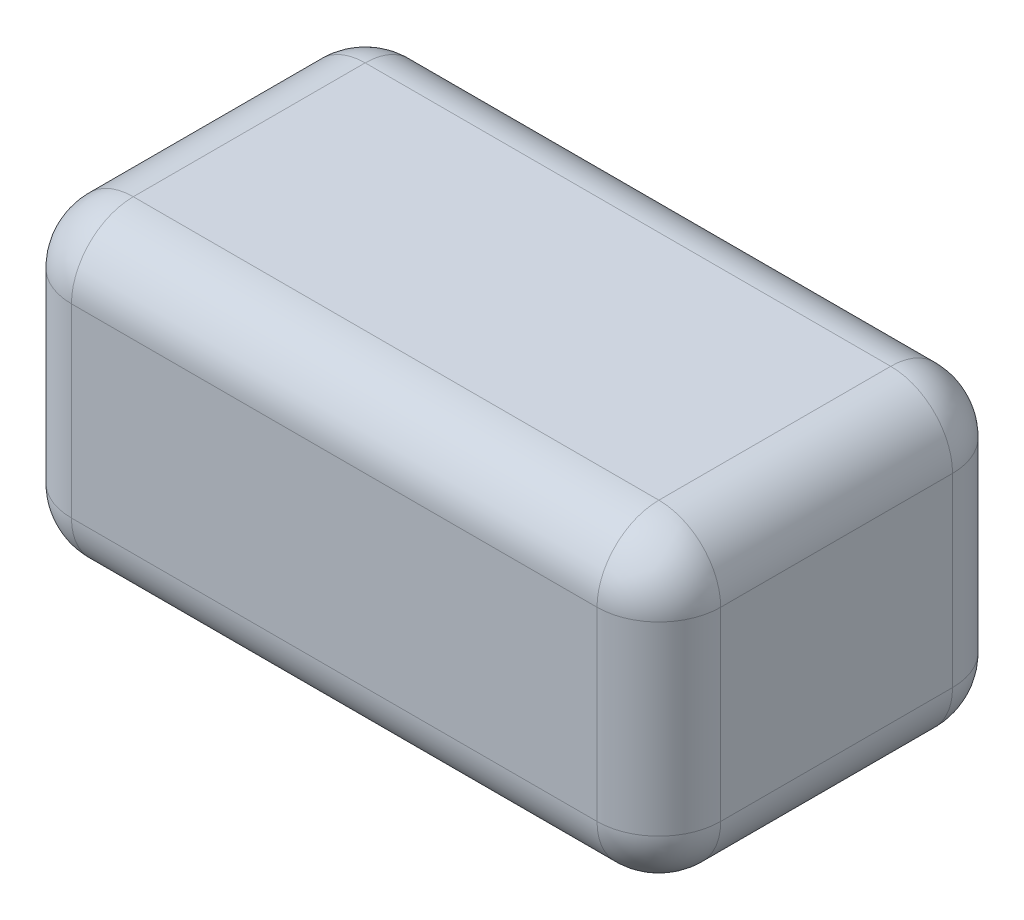
ISO-10303-21;
HEADER;
FILE_DESCRIPTION(('STEP AP214'),'2;1');
FILE_NAME('part.step','',(''),(''),'','','');
FILE_SCHEMA(('AUTOMOTIVE_DESIGN { 1 0 10303 214 1 1 1 1 }'));
ENDSEC;
DATA;
#1=APPLICATION_CONTEXT('core data for automotive mechanical design processes');
#2=APPLICATION_PROTOCOL_DEFINITION('international standard','automotive_design',2000,#1);
#3=PRODUCT_CONTEXT('',#1,'mechanical');
#4=PRODUCT('Part','Part','',(#3));
#5=PRODUCT_RELATED_PRODUCT_CATEGORY('part','',(#4));
#6=PRODUCT_DEFINITION_FORMATION('','',#4);
#7=PRODUCT_DEFINITION_CONTEXT('part definition',#1,'design');
#8=PRODUCT_DEFINITION('design','',#6,#7);
#9=PRODUCT_DEFINITION_SHAPE('','',#8);
#10=(LENGTH_UNIT() NAMED_UNIT(*) SI_UNIT(.MILLI.,.METRE.));
#11=(NAMED_UNIT(*) PLANE_ANGLE_UNIT() SI_UNIT($,.RADIAN.));
#12=(NAMED_UNIT(*) SI_UNIT($,.STERADIAN.) SOLID_ANGLE_UNIT());
#13=UNCERTAINTY_MEASURE_WITH_UNIT(LENGTH_MEASURE(1.E-05),#10,'distance_accuracy_value','');
#14=(GEOMETRIC_REPRESENTATION_CONTEXT(3) GLOBAL_UNCERTAINTY_ASSIGNED_CONTEXT((#13)) GLOBAL_UNIT_ASSIGNED_CONTEXT((#10,
#11,#12)) REPRESENTATION_CONTEXT('',''));
#15=CARTESIAN_POINT('',(0.,0.,0.));
#16=DIRECTION('',(0.,0.,1.));
#17=DIRECTION('',(1.,0.,0.));
#18=AXIS2_PLACEMENT_3D('',#15,#16,#17);
#19=CARTESIAN_POINT('',(-40.1154120486353,20.,-3.19729573644554));
#20=DIRECTION('',(1.,0.,0.));
#21=DIRECTION('',(0.,0.,-1.));
#22=AXIS2_PLACEMENT_3D('',#19,#20,#21);
#23=PLANE('',#22);
#24=DIRECTION('',(0.,-1.,0.));
#25=VECTOR('',#24,1.);
#26=CARTESIAN_POINT('',(-40.1154120486353,20.,15.8027042635545));
#27=LINE('',#26,#25);
#28=CARTESIAN_POINT('',(-40.1154120486353,4.,15.8027042635545));
#29=VERTEX_POINT('',#28);
#30=CARTESIAN_POINT('',(-40.1154120486353,16.,15.8027042635545));
#31=VERTEX_POINT('',#30);
#32=EDGE_CURVE('E128',#29,#31,#27,.F.);
#33=ORIENTED_EDGE('',*,*,#32,.T.);
#34=DIRECTION('',(0.,0.,1.));
#35=VECTOR('',#34,1.);
#36=CARTESIAN_POINT('',(-40.1154120486353,16.,-3.19729573644554));
#37=LINE('',#36,#35);
#38=CARTESIAN_POINT('',(-40.1154120486353,16.,0.802704263554461));
#39=VERTEX_POINT('',#38);
#40=EDGE_CURVE('E165',#31,#39,#37,.F.);
#41=ORIENTED_EDGE('',*,*,#40,.T.);
#42=DIRECTION('',(0.,-1.,0.));
#43=VECTOR('',#42,1.);
#44=CARTESIAN_POINT('',(-40.1154120486353,20.,0.802704263554461));
#45=LINE('',#44,#43);
#46=CARTESIAN_POINT('',(-40.1154120486353,4.,0.802704263554461));
#47=VERTEX_POINT('',#46);
#48=EDGE_CURVE('E162',#39,#47,#45,.T.);
#49=ORIENTED_EDGE('',*,*,#48,.T.);
#50=DIRECTION('',(0.,0.,1.));
#51=VECTOR('',#50,1.);
#52=CARTESIAN_POINT('',(-40.1154120486353,4.,-3.19729573644554));
#53=LINE('',#52,#51);
#54=EDGE_CURVE('E157',#47,#29,#53,.T.);
#55=ORIENTED_EDGE('',*,*,#54,.T.);
#56=EDGE_LOOP('',(#33,#41,#49,#55));
#57=FACE_BOUND('',#56,.T.);
#58=ADVANCED_FACE('F33',(#57),#23,.F.);
#59=CARTESIAN_POINT('',(-40.1154120486353,20.,19.8027042635545));
#60=DIRECTION('',(0.,0.,-1.));
#61=DIRECTION('',(-1.,0.,0.));
#62=AXIS2_PLACEMENT_3D('',#59,#60,#61);
#63=PLANE('',#62);
#64=DIRECTION('',(0.,-1.,0.));
#65=VECTOR('',#64,1.);
#66=CARTESIAN_POINT('',(-2.11541204863534,20.,19.8027042635545));
#67=LINE('',#66,#65);
#68=CARTESIAN_POINT('',(-2.11541204863533,4.,19.8027042635545));
#69=VERTEX_POINT('',#68);
#70=CARTESIAN_POINT('',(-2.11541204863533,16.,19.8027042635545));
#71=VERTEX_POINT('',#70);
#72=EDGE_CURVE('E150',#69,#71,#67,.F.);
#73=ORIENTED_EDGE('',*,*,#72,.T.);
#74=DIRECTION('',(1.,0.,0.));
#75=VECTOR('',#74,1.);
#76=CARTESIAN_POINT('',(-40.1154120486353,16.,19.8027042635545));
#77=LINE('',#76,#75);
#78=CARTESIAN_POINT('',(-36.1154120486353,16.,19.8027042635545));
#79=VERTEX_POINT('',#78);
#80=EDGE_CURVE('E154',#71,#79,#77,.F.);
#81=ORIENTED_EDGE('',*,*,#80,.T.);
#82=DIRECTION('',(0.,-1.,0.));
#83=VECTOR('',#82,1.);
#84=CARTESIAN_POINT('',(-36.1154120486353,20.,19.8027042635545));
#85=LINE('',#84,#83);
#86=CARTESIAN_POINT('',(-36.1154120486353,4.,19.8027042635545));
#87=VERTEX_POINT('',#86);
#88=EDGE_CURVE('E126',#79,#87,#85,.T.);
#89=ORIENTED_EDGE('',*,*,#88,.T.);
#90=DIRECTION('',(1.,0.,0.));
#91=VECTOR('',#90,1.);
#92=CARTESIAN_POINT('',(-40.1154120486353,4.,19.8027042635545));
#93=LINE('',#92,#91);
#94=EDGE_CURVE('E144',#87,#69,#93,.T.);
#95=ORIENTED_EDGE('',*,*,#94,.T.);
#96=EDGE_LOOP('',(#73,#81,#89,#95));
#97=FACE_BOUND('',#96,.T.);
#98=ADVANCED_FACE('F152',(#97),#63,.F.);
#99=CARTESIAN_POINT('',(1.88458795136466,20.,-3.19729573644554));
#100=DIRECTION('',(-1.,0.,0.));
#101=DIRECTION('',(0.,0.,1.));
#102=AXIS2_PLACEMENT_3D('',#99,#100,#101);
#103=PLANE('',#102);
#104=DIRECTION('',(0.,-1.,0.));
#105=VECTOR('',#104,1.);
#106=CARTESIAN_POINT('',(1.88458795136467,20.,0.80270426355446));
#107=LINE('',#106,#105);
#108=CARTESIAN_POINT('',(1.88458795136467,4.,0.80270426355446));
#109=VERTEX_POINT('',#108);
#110=CARTESIAN_POINT('',(1.88458795136467,16.,0.80270426355446));
#111=VERTEX_POINT('',#110);
#112=EDGE_CURVE('E169',#109,#111,#107,.F.);
#113=ORIENTED_EDGE('',*,*,#112,.T.);
#114=DIRECTION('',(0.,0.,-1.));
#115=VECTOR('',#114,1.);
#116=CARTESIAN_POINT('',(1.88458795136467,16.,19.8027042635545));
#117=LINE('',#116,#115);
#118=CARTESIAN_POINT('',(1.88458795136467,16.,15.8027042635545));
#119=VERTEX_POINT('',#118);
#120=EDGE_CURVE('E174',#111,#119,#117,.F.);
#121=ORIENTED_EDGE('',*,*,#120,.T.);
#122=DIRECTION('',(0.,-1.,0.));
#123=VECTOR('',#122,1.);
#124=CARTESIAN_POINT('',(1.88458795136467,20.,15.8027042635545));
#125=LINE('',#124,#123);
#126=CARTESIAN_POINT('',(1.88458795136467,4.,15.8027042635545));
#127=VERTEX_POINT('',#126);
#128=EDGE_CURVE('E171',#119,#127,#125,.T.);
#129=ORIENTED_EDGE('',*,*,#128,.T.);
#130=DIRECTION('',(0.,0.,-1.));
#131=VECTOR('',#130,1.);
#132=CARTESIAN_POINT('',(1.88458795136466,4.,-3.19729573644554));
#133=LINE('',#132,#131);
#134=EDGE_CURVE('E167',#127,#109,#133,.T.);
#135=ORIENTED_EDGE('',*,*,#134,.T.);
#136=EDGE_LOOP('',(#113,#121,#129,#135));
#137=FACE_BOUND('',#136,.T.);
#138=ADVANCED_FACE('F279',(#137),#103,.F.);
#139=CARTESIAN_POINT('',(-40.1154120486353,20.,-3.19729573644554));
#140=DIRECTION('',(0.,0.,1.));
#141=DIRECTION('',(1.,0.,0.));
#142=AXIS2_PLACEMENT_3D('',#139,#140,#141);
#143=PLANE('',#142);
#144=DIRECTION('',(0.,-1.,0.));
#145=VECTOR('',#144,1.);
#146=CARTESIAN_POINT('',(-36.1154120486353,20.,-3.19729573644554));
#147=LINE('',#146,#145);
#148=CARTESIAN_POINT('',(-36.1154120486353,4.,-3.19729573644554));
#149=VERTEX_POINT('',#148);
#150=CARTESIAN_POINT('',(-36.1154120486353,16.,-3.19729573644554));
#151=VERTEX_POINT('',#150);
#152=EDGE_CURVE('E178',#149,#151,#147,.F.);
#153=ORIENTED_EDGE('',*,*,#152,.T.);
#154=DIRECTION('',(-1.,0.,0.));
#155=VECTOR('',#154,1.);
#156=CARTESIAN_POINT('',(1.88458795136466,16.,-3.19729573644554));
#157=LINE('',#156,#155);
#158=CARTESIAN_POINT('',(-2.11541204863534,16.,-3.19729573644554));
#159=VERTEX_POINT('',#158);
#160=EDGE_CURVE('E183',#151,#159,#157,.F.);
#161=ORIENTED_EDGE('',*,*,#160,.T.);
#162=DIRECTION('',(0.,-1.,0.));
#163=VECTOR('',#162,1.);
#164=CARTESIAN_POINT('',(-2.11541204863534,20.,-3.19729573644554));
#165=LINE('',#164,#163);
#166=CARTESIAN_POINT('',(-2.11541204863534,4.,-3.19729573644554));
#167=VERTEX_POINT('',#166);
#168=EDGE_CURVE('E180',#159,#167,#165,.T.);
#169=ORIENTED_EDGE('',*,*,#168,.T.);
#170=DIRECTION('',(-1.,0.,0.));
#171=VECTOR('',#170,1.);
#172=CARTESIAN_POINT('',(-40.1154120486353,4.,-3.19729573644554));
#173=LINE('',#172,#171);
#174=EDGE_CURVE('E176',#167,#149,#173,.T.);
#175=ORIENTED_EDGE('',*,*,#174,.T.);
#176=EDGE_LOOP('',(#153,#161,#169,#175));
#177=FACE_BOUND('',#176,.T.);
#178=ADVANCED_FACE('F289',(#177),#143,.F.);
#179=CARTESIAN_POINT('',(0.,20.,0.));
#180=DIRECTION('',(0.,1.,0.));
#181=DIRECTION('',(0.,0.,1.));
#182=AXIS2_PLACEMENT_3D('',#179,#180,#181);
#183=PLANE('',#182);
#184=DIRECTION('',(0.,0.,-1.));
#185=VECTOR('',#184,1.);
#186=CARTESIAN_POINT('',(-2.11541204863533,20.,-3.19729573644554));
#187=LINE('',#186,#185);
#188=CARTESIAN_POINT('',(-2.11541204863533,20.,15.8027042635545));
#189=VERTEX_POINT('',#188);
#190=CARTESIAN_POINT('',(-2.11541204863533,20.,0.802704263554461));
#191=VERTEX_POINT('',#190);
#192=EDGE_CURVE('E189',#189,#191,#187,.T.);
#193=ORIENTED_EDGE('',*,*,#192,.T.);
#194=DIRECTION('',(-1.,0.,0.));
#195=VECTOR('',#194,1.);
#196=CARTESIAN_POINT('',(-40.1154120486353,20.,0.802704263554461));
#197=LINE('',#196,#195);
#198=CARTESIAN_POINT('',(-36.1154120486353,20.,0.802704263554461));
#199=VERTEX_POINT('',#198);
#200=EDGE_CURVE('E191',#191,#199,#197,.T.);
#201=ORIENTED_EDGE('',*,*,#200,.T.);
#202=DIRECTION('',(0.,0.,1.));
#203=VECTOR('',#202,1.);
#204=CARTESIAN_POINT('',(-36.1154120486353,20.,19.8027042635545));
#205=LINE('',#204,#203);
#206=CARTESIAN_POINT('',(-36.1154120486353,20.,15.8027042635545));
#207=VERTEX_POINT('',#206);
#208=EDGE_CURVE('E185',#199,#207,#205,.T.);
#209=ORIENTED_EDGE('',*,*,#208,.T.);
#210=DIRECTION('',(1.,0.,0.));
#211=VECTOR('',#210,1.);
#212=CARTESIAN_POINT('',(1.88458795136467,20.,15.8027042635545));
#213=LINE('',#212,#211);
#214=EDGE_CURVE('E187',#207,#189,#213,.T.);
#215=ORIENTED_EDGE('',*,*,#214,.T.);
#216=EDGE_LOOP('',(#193,#201,#209,#215));
#217=FACE_BOUND('',#216,.T.);
#218=ADVANCED_FACE('F271',(#217),#183,.T.);
#219=CARTESIAN_POINT('',(0.,0.,0.));
#220=DIRECTION('',(0.,1.,0.));
#221=DIRECTION('',(0.,0.,1.));
#222=AXIS2_PLACEMENT_3D('',#219,#220,#221);
#223=PLANE('',#222);
#224=DIRECTION('',(0.,0.,1.));
#225=VECTOR('',#224,1.);
#226=CARTESIAN_POINT('',(-36.1154120486353,0.,0.));
#227=LINE('',#226,#225);
#228=CARTESIAN_POINT('',(-36.1154120486353,0.,15.8027042635545));
#229=VERTEX_POINT('',#228);
#230=CARTESIAN_POINT('',(-36.1154120486353,0.,0.802704263554461));
#231=VERTEX_POINT('',#230);
#232=EDGE_CURVE('E194',#229,#231,#227,.F.);
#233=ORIENTED_EDGE('',*,*,#232,.T.);
#234=DIRECTION('',(-1.,0.,0.));
#235=VECTOR('',#234,1.);
#236=CARTESIAN_POINT('',(0.,0.,0.802704263554461));
#237=LINE('',#236,#235);
#238=CARTESIAN_POINT('',(-2.11541204863533,0.,0.802704263554461));
#239=VERTEX_POINT('',#238);
#240=EDGE_CURVE('E11',#231,#239,#237,.F.);
#241=ORIENTED_EDGE('',*,*,#240,.T.);
#242=DIRECTION('',(0.,0.,-1.));
#243=VECTOR('',#242,1.);
#244=CARTESIAN_POINT('',(-2.11541204863533,0.,0.));
#245=LINE('',#244,#243);
#246=CARTESIAN_POINT('',(-2.11541204863533,0.,15.8027042635545));
#247=VERTEX_POINT('',#246);
#248=EDGE_CURVE('E42',#239,#247,#245,.F.);
#249=ORIENTED_EDGE('',*,*,#248,.T.);
#250=DIRECTION('',(1.,0.,0.));
#251=VECTOR('',#250,1.);
#252=CARTESIAN_POINT('',(0.,0.,15.8027042635545));
#253=LINE('',#252,#251);
#254=EDGE_CURVE('E196',#247,#229,#253,.F.);
#255=ORIENTED_EDGE('',*,*,#254,.T.);
#256=EDGE_LOOP('',(#233,#241,#249,#255));
#257=FACE_BOUND('',#256,.T.);
#258=ADVANCED_FACE('F478',(#257),#223,.F.);
#259=CARTESIAN_POINT('',(-2.11541204863534,20.,0.802704263554461));
#260=DIRECTION('',(0.,-1.,0.));
#261=DIRECTION('',(0.,0.,-1.));
#262=AXIS2_PLACEMENT_3D('',#259,#260,#261);
#263=CYLINDRICAL_SURFACE('',#262,4.);
#264=CARTESIAN_POINT('',(-2.11541204863533,16.,0.802704263554461));
#265=DIRECTION('',(0.,1.,0.));
#266=DIRECTION('',(0.,0.,1.));
#267=AXIS2_PLACEMENT_3D('',#264,#265,#266);
#268=CIRCLE('',#267,4.);
#269=EDGE_CURVE('E37',#111,#159,#268,.T.);
#270=ORIENTED_EDGE('',*,*,#269,.F.);
#271=ORIENTED_EDGE('',*,*,#112,.F.);
#272=CARTESIAN_POINT('',(-2.11541204863534,4.,0.802704263554461));
#273=DIRECTION('',(0.,-1.,0.));
#274=DIRECTION('',(0.,0.,-1.));
#275=AXIS2_PLACEMENT_3D('',#272,#273,#274);
#276=CIRCLE('',#275,4.);
#277=EDGE_CURVE('E249',#167,#109,#276,.T.);
#278=ORIENTED_EDGE('',*,*,#277,.F.);
#279=ORIENTED_EDGE('',*,*,#168,.F.);
#280=EDGE_LOOP('',(#270,#271,#278,#279));
#281=FACE_BOUND('',#280,.T.);
#282=ADVANCED_FACE('F35',(#281),#263,.T.);
#283=CARTESIAN_POINT('',(-2.11541204863533,16.,0.802704263554461));
#284=DIRECTION('',(0.,0.,1.));
#285=DIRECTION('',(1.,0.,0.));
#286=AXIS2_PLACEMENT_3D('',#283,#284,#285);
#287=SPHERICAL_SURFACE('',#286,4.);
#288=CARTESIAN_POINT('',(-2.11541204863533,16.,0.802704263554461));
#289=DIRECTION('',(0.,0.,-1.));
#290=DIRECTION('',(-1.,0.,0.));
#291=AXIS2_PLACEMENT_3D('',#288,#289,#290);
#292=CIRCLE('',#291,4.);
#293=EDGE_CURVE('E244',#111,#191,#292,.F.);
#294=ORIENTED_EDGE('',*,*,#293,.F.);
#295=ORIENTED_EDGE('',*,*,#269,.T.);
#296=CARTESIAN_POINT('',(-2.11541204863534,16.,0.802704263554461));
#297=DIRECTION('',(1.,0.,0.));
#298=DIRECTION('',(0.,1.,0.));
#299=AXIS2_PLACEMENT_3D('',#296,#297,#298);
#300=CIRCLE('',#299,4.);
#301=EDGE_CURVE('E247',#191,#159,#300,.F.);
#302=ORIENTED_EDGE('',*,*,#301,.F.);
#303=EDGE_LOOP('',(#294,#295,#302));
#304=FACE_BOUND('',#303,.T.);
#305=ADVANCED_FACE('F259',(#304),#287,.T.);
#306=CARTESIAN_POINT('',(-2.11541204863533,4.,0.802704263554461));
#307=DIRECTION('',(0.,0.,1.));
#308=DIRECTION('',(1.,0.,0.));
#309=AXIS2_PLACEMENT_3D('',#306,#307,#308);
#310=SPHERICAL_SURFACE('',#309,4.);
#311=CARTESIAN_POINT('',(-2.11541204863533,4.,0.802704263554461));
#312=DIRECTION('',(1.,0.,0.));
#313=DIRECTION('',(0.,0.,-1.));
#314=AXIS2_PLACEMENT_3D('',#311,#312,#313);
#315=CIRCLE('',#314,4.);
#316=EDGE_CURVE('E239',#167,#239,#315,.F.);
#317=ORIENTED_EDGE('',*,*,#316,.F.);
#318=ORIENTED_EDGE('',*,*,#277,.T.);
#319=CARTESIAN_POINT('',(-2.11541204863533,4.,0.802704263554461));
#320=DIRECTION('',(0.,0.,-1.));
#321=DIRECTION('',(-1.,0.,0.));
#322=AXIS2_PLACEMENT_3D('',#319,#320,#321);
#323=CIRCLE('',#322,4.);
#324=EDGE_CURVE('E242',#239,#109,#323,.F.);
#325=ORIENTED_EDGE('',*,*,#324,.F.);
#326=EDGE_LOOP('',(#317,#318,#325));
#327=FACE_BOUND('',#326,.T.);
#328=ADVANCED_FACE('F457',(#327),#310,.T.);
#329=CARTESIAN_POINT('',(0.,16.,0.802704263554461));
#330=DIRECTION('',(1.,0.,0.));
#331=DIRECTION('',(0.,0.,-1.));
#332=AXIS2_PLACEMENT_3D('',#329,#330,#331);
#333=CYLINDRICAL_SURFACE('',#332,4.);
#334=ORIENTED_EDGE('',*,*,#301,.T.);
#335=ORIENTED_EDGE('',*,*,#160,.F.);
#336=CARTESIAN_POINT('',(-36.1154120486353,16.,0.802704263554461));
#337=DIRECTION('',(-1.,0.,0.));
#338=DIRECTION('',(0.,0.,1.));
#339=AXIS2_PLACEMENT_3D('',#336,#337,#338);
#340=CIRCLE('',#339,4.);
#341=EDGE_CURVE('E233',#199,#151,#340,.T.);
#342=ORIENTED_EDGE('',*,*,#341,.F.);
#343=ORIENTED_EDGE('',*,*,#200,.F.);
#344=EDGE_LOOP('',(#334,#335,#342,#343));
#345=FACE_BOUND('',#344,.T.);
#346=ADVANCED_FACE('F267',(#345),#333,.T.);
#347=CARTESIAN_POINT('',(-2.11541204863533,16.,0.));
#348=DIRECTION('',(0.,0.,1.));
#349=DIRECTION('',(1.,0.,0.));
#350=AXIS2_PLACEMENT_3D('',#347,#348,#349);
#351=CYLINDRICAL_SURFACE('',#350,4.);
#352=ORIENTED_EDGE('',*,*,#293,.T.);
#353=ORIENTED_EDGE('',*,*,#192,.F.);
#354=CARTESIAN_POINT('',(-2.11541204863533,16.,15.8027042635545));
#355=DIRECTION('',(0.,0.,1.));
#356=DIRECTION('',(1.,0.,0.));
#357=AXIS2_PLACEMENT_3D('',#354,#355,#356);
#358=CIRCLE('',#357,4.);
#359=EDGE_CURVE('E230',#119,#189,#358,.T.);
#360=ORIENTED_EDGE('',*,*,#359,.F.);
#361=ORIENTED_EDGE('',*,*,#120,.F.);
#362=EDGE_LOOP('',(#352,#353,#360,#361));
#363=FACE_BOUND('',#362,.T.);
#364=ADVANCED_FACE('F276',(#363),#351,.T.);
#365=CARTESIAN_POINT('',(-2.11541204863533,20.,15.8027042635545));
#366=DIRECTION('',(0.,-1.,0.));
#367=DIRECTION('',(0.,0.,-1.));
#368=AXIS2_PLACEMENT_3D('',#365,#366,#367);
#369=CYLINDRICAL_SURFACE('',#368,4.);
#370=CARTESIAN_POINT('',(-2.11541204863533,4.,15.8027042635545));
#371=DIRECTION('',(0.,-1.,0.));
#372=DIRECTION('',(0.,0.,-1.));
#373=AXIS2_PLACEMENT_3D('',#370,#371,#372);
#374=CIRCLE('',#373,4.);
#375=EDGE_CURVE('E224',#127,#69,#374,.T.);
#376=ORIENTED_EDGE('',*,*,#375,.F.);
#377=ORIENTED_EDGE('',*,*,#128,.F.);
#378=CARTESIAN_POINT('',(-2.11541204863533,16.,15.8027042635545));
#379=DIRECTION('',(0.,1.,0.));
#380=DIRECTION('',(0.,0.,1.));
#381=AXIS2_PLACEMENT_3D('',#378,#379,#380);
#382=CIRCLE('',#381,4.);
#383=EDGE_CURVE('E227',#71,#119,#382,.T.);
#384=ORIENTED_EDGE('',*,*,#383,.F.);
#385=ORIENTED_EDGE('',*,*,#72,.F.);
#386=EDGE_LOOP('',(#376,#377,#384,#385));
#387=FACE_BOUND('',#386,.T.);
#388=ADVANCED_FACE('F283',(#387),#369,.T.);
#389=CARTESIAN_POINT('',(-2.11541204863533,4.,-3.19729573644554));
#390=DIRECTION('',(0.,0.,-1.));
#391=DIRECTION('',(-1.,0.,0.));
#392=AXIS2_PLACEMENT_3D('',#389,#390,#391);
#393=CYLINDRICAL_SURFACE('',#392,4.);
#394=ORIENTED_EDGE('',*,*,#324,.T.);
#395=ORIENTED_EDGE('',*,*,#134,.F.);
#396=CARTESIAN_POINT('',(-2.11541204863533,4.,15.8027042635545));
#397=DIRECTION('',(0.,0.,1.));
#398=DIRECTION('',(1.,0.,0.));
#399=AXIS2_PLACEMENT_3D('',#396,#397,#398);
#400=CIRCLE('',#399,4.);
#401=EDGE_CURVE('E222',#247,#127,#400,.T.);
#402=ORIENTED_EDGE('',*,*,#401,.F.);
#403=ORIENTED_EDGE('',*,*,#248,.F.);
#404=EDGE_LOOP('',(#394,#395,#402,#403));
#405=FACE_BOUND('',#404,.T.);
#406=ADVANCED_FACE('F287',(#405),#393,.T.);
#407=CARTESIAN_POINT('',(-40.1154120486353,4.,0.802704263554461));
#408=DIRECTION('',(-1.,0.,0.));
#409=DIRECTION('',(0.,0.,1.));
#410=AXIS2_PLACEMENT_3D('',#407,#408,#409);
#411=CYLINDRICAL_SURFACE('',#410,4.);
#412=ORIENTED_EDGE('',*,*,#316,.T.);
#413=ORIENTED_EDGE('',*,*,#240,.F.);
#414=CARTESIAN_POINT('',(-36.1154120486353,4.,0.802704263554461));
#415=DIRECTION('',(-1.,0.,0.));
#416=DIRECTION('',(0.,0.,1.));
#417=AXIS2_PLACEMENT_3D('',#414,#415,#416);
#418=CIRCLE('',#417,4.);
#419=EDGE_CURVE('E219',#149,#231,#418,.T.);
#420=ORIENTED_EDGE('',*,*,#419,.F.);
#421=ORIENTED_EDGE('',*,*,#174,.F.);
#422=EDGE_LOOP('',(#412,#413,#420,#421));
#423=FACE_BOUND('',#422,.T.);
#424=ADVANCED_FACE('F299',(#423),#411,.T.);
#425=CARTESIAN_POINT('',(-36.1154120486353,20.,0.802704263554461));
#426=DIRECTION('',(0.,-1.,0.));
#427=DIRECTION('',(0.,0.,-1.));
#428=AXIS2_PLACEMENT_3D('',#425,#426,#427);
#429=CYLINDRICAL_SURFACE('',#428,4.);
#430=CARTESIAN_POINT('',(-36.1154120486353,16.,0.802704263554461));
#431=DIRECTION('',(0.,1.,0.));
#432=DIRECTION('',(0.,0.,1.));
#433=AXIS2_PLACEMENT_3D('',#430,#431,#432);
#434=CIRCLE('',#433,4.);
#435=EDGE_CURVE('E236',#151,#39,#434,.T.);
#436=ORIENTED_EDGE('',*,*,#435,.F.);
#437=ORIENTED_EDGE('',*,*,#152,.F.);
#438=CARTESIAN_POINT('',(-36.1154120486353,4.,0.802704263554461));
#439=DIRECTION('',(0.,-1.,0.));
#440=DIRECTION('',(0.,0.,-1.));
#441=AXIS2_PLACEMENT_3D('',#438,#439,#440);
#442=CIRCLE('',#441,4.);
#443=EDGE_CURVE('E216',#47,#149,#442,.T.);
#444=ORIENTED_EDGE('',*,*,#443,.F.);
#445=ORIENTED_EDGE('',*,*,#48,.F.);
#446=EDGE_LOOP('',(#436,#437,#444,#445));
#447=FACE_BOUND('',#446,.T.);
#448=ADVANCED_FACE('F294',(#447),#429,.T.);
#449=CARTESIAN_POINT('',(-36.1154120486353,16.,0.802704263554461));
#450=DIRECTION('',(0.,0.,1.));
#451=DIRECTION('',(1.,0.,0.));
#452=AXIS2_PLACEMENT_3D('',#449,#450,#451);
#453=SPHERICAL_SURFACE('',#452,4.);
#454=ORIENTED_EDGE('',*,*,#341,.T.);
#455=ORIENTED_EDGE('',*,*,#435,.T.);
#456=CARTESIAN_POINT('',(-36.1154120486353,16.,0.802704263554461));
#457=DIRECTION('',(0.,0.,-1.));
#458=DIRECTION('',(-1.,0.,0.));
#459=AXIS2_PLACEMENT_3D('',#456,#457,#458);
#460=CIRCLE('',#459,4.);
#461=EDGE_CURVE('E213',#199,#39,#460,.F.);
#462=ORIENTED_EDGE('',*,*,#461,.F.);
#463=EDGE_LOOP('',(#454,#455,#462));
#464=FACE_BOUND('',#463,.T.);
#465=ADVANCED_FACE('F310',(#464),#453,.T.);
#466=CARTESIAN_POINT('',(-2.11541204863533,16.,15.8027042635545));
#467=DIRECTION('',(0.,0.,1.));
#468=DIRECTION('',(1.,0.,0.));
#469=AXIS2_PLACEMENT_3D('',#466,#467,#468);
#470=SPHERICAL_SURFACE('',#469,4.);
#471=ORIENTED_EDGE('',*,*,#383,.T.);
#472=ORIENTED_EDGE('',*,*,#359,.T.);
#473=CARTESIAN_POINT('',(-2.11541204863533,16.,15.8027042635545));
#474=DIRECTION('',(1.,0.,0.));
#475=DIRECTION('',(0.,0.,-1.));
#476=AXIS2_PLACEMENT_3D('',#473,#474,#475);
#477=CIRCLE('',#476,4.);
#478=EDGE_CURVE('E210',#71,#189,#477,.F.);
#479=ORIENTED_EDGE('',*,*,#478,.F.);
#480=EDGE_LOOP('',(#471,#472,#479));
#481=FACE_BOUND('',#480,.T.);
#482=ADVANCED_FACE('F320',(#481),#470,.T.);
#483=CARTESIAN_POINT('',(-2.11541204863533,4.,15.8027042635545));
#484=DIRECTION('',(0.,0.,1.));
#485=DIRECTION('',(1.,0.,0.));
#486=AXIS2_PLACEMENT_3D('',#483,#484,#485);
#487=SPHERICAL_SURFACE('',#486,4.);
#488=ORIENTED_EDGE('',*,*,#401,.T.);
#489=ORIENTED_EDGE('',*,*,#375,.T.);
#490=CARTESIAN_POINT('',(-2.11541204863533,4.,15.8027042635545));
#491=DIRECTION('',(1.,0.,0.));
#492=DIRECTION('',(0.,0.,-1.));
#493=AXIS2_PLACEMENT_3D('',#490,#491,#492);
#494=CIRCLE('',#493,4.);
#495=EDGE_CURVE('E147',#247,#69,#494,.F.);
#496=ORIENTED_EDGE('',*,*,#495,.F.);
#497=EDGE_LOOP('',(#488,#489,#496));
#498=FACE_BOUND('',#497,.T.);
#499=ADVANCED_FACE('F322',(#498),#487,.T.);
#500=CARTESIAN_POINT('',(-36.1154120486353,4.,0.802704263554461));
#501=DIRECTION('',(0.,0.,1.));
#502=DIRECTION('',(1.,0.,0.));
#503=AXIS2_PLACEMENT_3D('',#500,#501,#502);
#504=SPHERICAL_SURFACE('',#503,4.);
#505=ORIENTED_EDGE('',*,*,#443,.T.);
#506=ORIENTED_EDGE('',*,*,#419,.T.);
#507=CARTESIAN_POINT('',(-36.1154120486353,4.,0.802704263554461));
#508=DIRECTION('',(0.,0.,-1.));
#509=DIRECTION('',(-1.,0.,0.));
#510=AXIS2_PLACEMENT_3D('',#507,#508,#509);
#511=CIRCLE('',#510,4.);
#512=EDGE_CURVE('E206',#47,#231,#511,.F.);
#513=ORIENTED_EDGE('',*,*,#512,.F.);
#514=EDGE_LOOP('',(#505,#506,#513));
#515=FACE_BOUND('',#514,.T.);
#516=ADVANCED_FACE('F301',(#515),#504,.T.);
#517=CARTESIAN_POINT('',(-36.1154120486353,16.,0.));
#518=DIRECTION('',(0.,0.,-1.));
#519=DIRECTION('',(-1.,0.,0.));
#520=AXIS2_PLACEMENT_3D('',#517,#518,#519);
#521=CYLINDRICAL_SURFACE('',#520,4.);
#522=ORIENTED_EDGE('',*,*,#461,.T.);
#523=ORIENTED_EDGE('',*,*,#40,.F.);
#524=CARTESIAN_POINT('',(-36.1154120486353,16.,15.8027042635545));
#525=DIRECTION('',(0.,0.,1.));
#526=DIRECTION('',(1.,0.,0.));
#527=AXIS2_PLACEMENT_3D('',#524,#525,#526);
#528=CIRCLE('',#527,4.);
#529=EDGE_CURVE('E203',#207,#31,#528,.T.);
#530=ORIENTED_EDGE('',*,*,#529,.F.);
#531=ORIENTED_EDGE('',*,*,#208,.F.);
#532=EDGE_LOOP('',(#522,#523,#530,#531));
#533=FACE_BOUND('',#532,.T.);
#534=ADVANCED_FACE('F312',(#533),#521,.T.);
#535=CARTESIAN_POINT('',(0.,16.,15.8027042635545));
#536=DIRECTION('',(-1.,0.,0.));
#537=DIRECTION('',(0.,0.,1.));
#538=AXIS2_PLACEMENT_3D('',#535,#536,#537);
#539=CYLINDRICAL_SURFACE('',#538,4.);
#540=ORIENTED_EDGE('',*,*,#478,.T.);
#541=ORIENTED_EDGE('',*,*,#214,.F.);
#542=CARTESIAN_POINT('',(-36.1154120486353,16.,15.8027042635545));
#543=DIRECTION('',(-1.,0.,0.));
#544=DIRECTION('',(0.,0.,1.));
#545=AXIS2_PLACEMENT_3D('',#542,#543,#544);
#546=CIRCLE('',#545,4.);
#547=EDGE_CURVE('E141',#79,#207,#546,.T.);
#548=ORIENTED_EDGE('',*,*,#547,.F.);
#549=ORIENTED_EDGE('',*,*,#80,.F.);
#550=EDGE_LOOP('',(#540,#541,#548,#549));
#551=FACE_BOUND('',#550,.T.);
#552=ADVANCED_FACE('F318',(#551),#539,.T.);
#553=CARTESIAN_POINT('',(-40.1154120486353,4.,15.8027042635545));
#554=DIRECTION('',(1.,0.,0.));
#555=DIRECTION('',(0.,0.,-1.));
#556=AXIS2_PLACEMENT_3D('',#553,#554,#555);
#557=CYLINDRICAL_SURFACE('',#556,4.);
#558=ORIENTED_EDGE('',*,*,#495,.T.);
#559=ORIENTED_EDGE('',*,*,#94,.F.);
#560=CARTESIAN_POINT('',(-36.1154120486353,4.,15.8027042635545));
#561=DIRECTION('',(-1.,0.,0.));
#562=DIRECTION('',(0.,0.,1.));
#563=AXIS2_PLACEMENT_3D('',#560,#561,#562);
#564=CIRCLE('',#563,4.);
#565=EDGE_CURVE('E134',#229,#87,#564,.T.);
#566=ORIENTED_EDGE('',*,*,#565,.F.);
#567=ORIENTED_EDGE('',*,*,#254,.F.);
#568=EDGE_LOOP('',(#558,#559,#566,#567));
#569=FACE_BOUND('',#568,.T.);
#570=ADVANCED_FACE('F145',(#569),#557,.T.);
#571=CARTESIAN_POINT('',(-36.1154120486353,4.,-3.19729573644554));
#572=DIRECTION('',(0.,0.,1.));
#573=DIRECTION('',(1.,0.,0.));
#574=AXIS2_PLACEMENT_3D('',#571,#572,#573);
#575=CYLINDRICAL_SURFACE('',#574,4.);
#576=ORIENTED_EDGE('',*,*,#512,.T.);
#577=ORIENTED_EDGE('',*,*,#232,.F.);
#578=CARTESIAN_POINT('',(-36.1154120486353,4.,15.8027042635545));
#579=DIRECTION('',(0.,0.,1.));
#580=DIRECTION('',(1.,0.,0.));
#581=AXIS2_PLACEMENT_3D('',#578,#579,#580);
#582=CIRCLE('',#581,4.);
#583=EDGE_CURVE('E138',#29,#229,#582,.T.);
#584=ORIENTED_EDGE('',*,*,#583,.F.);
#585=ORIENTED_EDGE('',*,*,#54,.F.);
#586=EDGE_LOOP('',(#576,#577,#584,#585));
#587=FACE_BOUND('',#586,.T.);
#588=ADVANCED_FACE('F305',(#587),#575,.T.);
#589=CARTESIAN_POINT('',(-36.1154120486353,16.,15.8027042635545));
#590=DIRECTION('',(0.,0.,1.));
#591=DIRECTION('',(1.,0.,0.));
#592=AXIS2_PLACEMENT_3D('',#589,#590,#591);
#593=SPHERICAL_SURFACE('',#592,4.);
#594=ORIENTED_EDGE('',*,*,#547,.T.);
#595=ORIENTED_EDGE('',*,*,#529,.T.);
#596=CARTESIAN_POINT('',(-36.1154120486353,16.,15.8027042635545));
#597=DIRECTION('',(0.,1.,0.));
#598=DIRECTION('',(0.,0.,1.));
#599=AXIS2_PLACEMENT_3D('',#596,#597,#598);
#600=CIRCLE('',#599,4.);
#601=EDGE_CURVE('E131',#79,#31,#600,.F.);
#602=ORIENTED_EDGE('',*,*,#601,.F.);
#603=EDGE_LOOP('',(#594,#595,#602));
#604=FACE_BOUND('',#603,.T.);
#605=ADVANCED_FACE('F316',(#604),#593,.T.);
#606=CARTESIAN_POINT('',(-36.1154120486353,4.,15.8027042635545));
#607=DIRECTION('',(0.,0.,1.));
#608=DIRECTION('',(1.,0.,0.));
#609=AXIS2_PLACEMENT_3D('',#606,#607,#608);
#610=SPHERICAL_SURFACE('',#609,4.);
#611=ORIENTED_EDGE('',*,*,#583,.T.);
#612=ORIENTED_EDGE('',*,*,#565,.T.);
#613=CARTESIAN_POINT('',(-36.1154120486353,4.,15.8027042635545));
#614=DIRECTION('',(0.,-1.,0.));
#615=DIRECTION('',(0.,0.,-1.));
#616=AXIS2_PLACEMENT_3D('',#613,#614,#615);
#617=CIRCLE('',#616,4.);
#618=EDGE_CURVE('E122',#29,#87,#617,.F.);
#619=ORIENTED_EDGE('',*,*,#618,.F.);
#620=EDGE_LOOP('',(#611,#612,#619));
#621=FACE_BOUND('',#620,.T.);
#622=ADVANCED_FACE('F136',(#621),#610,.T.);
#623=CARTESIAN_POINT('',(-36.1154120486353,20.,15.8027042635545));
#624=DIRECTION('',(0.,-1.,0.));
#625=DIRECTION('',(0.,0.,-1.));
#626=AXIS2_PLACEMENT_3D('',#623,#624,#625);
#627=CYLINDRICAL_SURFACE('',#626,4.);
#628=ORIENTED_EDGE('',*,*,#601,.T.);
#629=ORIENTED_EDGE('',*,*,#32,.F.);
#630=ORIENTED_EDGE('',*,*,#618,.T.);
#631=ORIENTED_EDGE('',*,*,#88,.F.);
#632=EDGE_LOOP('',(#628,#629,#630,#631));
#633=FACE_BOUND('',#632,.T.);
#634=ADVANCED_FACE('F124',(#633),#627,.T.);
#635=CLOSED_SHELL('',(#58,#98,#138,#178,#218,#258,#282,#305,#328,#346,#364,#388,#406,#424,#448,
#465,#482,#499,#516,#534,#552,#570,#588,#605,#622,#634));
#636=MANIFOLD_SOLID_BREP('B2',#635);
#637=ADVANCED_BREP_SHAPE_REPRESENTATION('',(#18,#636),#14);
#638=SHAPE_DEFINITION_REPRESENTATION(#9,#637);
ENDSEC;
END-ISO-10303-21;
